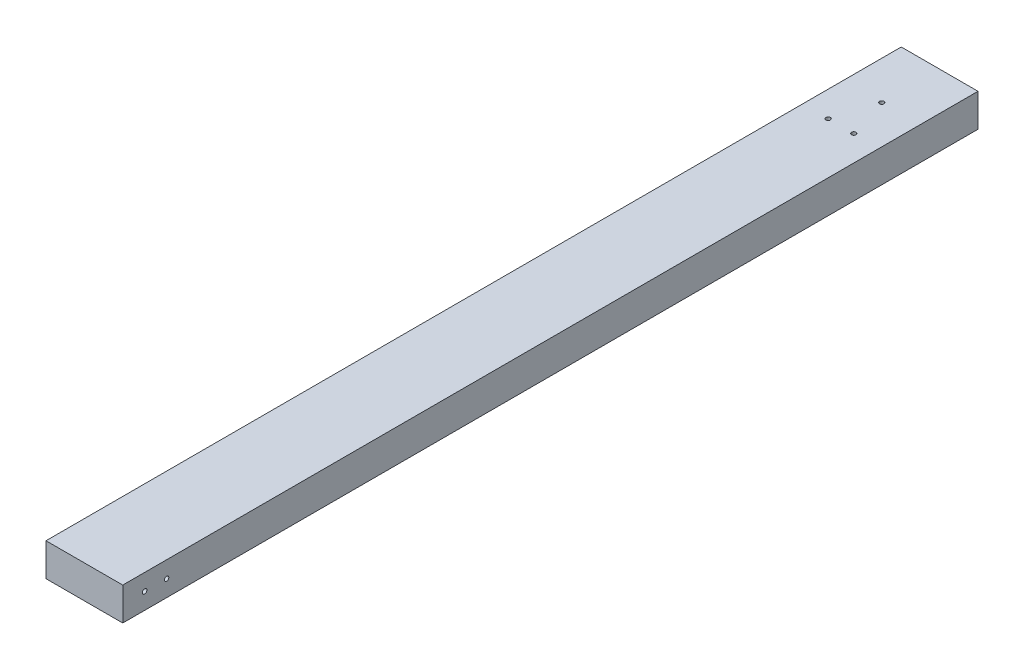
ISO-10303-21;
HEADER;
FILE_DESCRIPTION(('STEP AP214'),'2;1');
FILE_NAME('part.step','',(''),(''),'','','');
FILE_SCHEMA(('AUTOMOTIVE_DESIGN { 1 0 10303 214 1 1 1 1 }'));
ENDSEC;
DATA;
#1=APPLICATION_CONTEXT('core data for automotive mechanical design processes');
#2=APPLICATION_PROTOCOL_DEFINITION('international standard','automotive_design',2000,#1);
#3=PRODUCT_CONTEXT('',#1,'mechanical');
#4=PRODUCT('Part','Part','',(#3));
#5=PRODUCT_RELATED_PRODUCT_CATEGORY('part','',(#4));
#6=PRODUCT_DEFINITION_FORMATION('','',#4);
#7=PRODUCT_DEFINITION_CONTEXT('part definition',#1,'design');
#8=PRODUCT_DEFINITION('design','',#6,#7);
#9=PRODUCT_DEFINITION_SHAPE('','',#8);
#10=(LENGTH_UNIT() NAMED_UNIT(*) SI_UNIT(.MILLI.,.METRE.));
#11=(NAMED_UNIT(*) PLANE_ANGLE_UNIT() SI_UNIT($,.RADIAN.));
#12=(NAMED_UNIT(*) SI_UNIT($,.STERADIAN.) SOLID_ANGLE_UNIT());
#13=UNCERTAINTY_MEASURE_WITH_UNIT(LENGTH_MEASURE(1.E-05),#10,'distance_accuracy_value','');
#14=(GEOMETRIC_REPRESENTATION_CONTEXT(3) GLOBAL_UNCERTAINTY_ASSIGNED_CONTEXT((#13)) GLOBAL_UNIT_ASSIGNED_CONTEXT((#10,
#11,#12)) REPRESENTATION_CONTEXT('',''));
#15=CARTESIAN_POINT('',(0.,0.,0.));
#16=DIRECTION('',(0.,0.,1.));
#17=DIRECTION('',(1.,0.,0.));
#18=AXIS2_PLACEMENT_3D('',#15,#16,#17);
#19=CARTESIAN_POINT('',(-88.9,42.1769886363636,990.6));
#20=DIRECTION('',(1.,0.,0.));
#21=DIRECTION('',(0.,0.,-1.));
#22=AXIS2_PLACEMENT_3D('',#19,#20,#21);
#23=PLANE('',#22);
#24=CARTESIAN_POINT('',(-88.9,23.1269886363636,939.8));
#25=DIRECTION('',(-1.,0.,0.));
#26=DIRECTION('',(0.,0.,1.));
#27=AXIS2_PLACEMENT_3D('',#24,#25,#26);
#28=CIRCLE('',#27,2.57968750000001);
#29=CARTESIAN_POINT('',(-88.9,23.1269886363636,942.3796875));
#30=VERTEX_POINT('',#29);
#31=EDGE_CURVE('E137',#30,#30,#28,.T.);
#32=ORIENTED_EDGE('',*,*,#31,.F.);
#33=EDGE_LOOP('',(#32));
#34=FACE_BOUND('',#33,.T.);
#35=CARTESIAN_POINT('',(-88.9,23.1269886363636,965.2));
#36=DIRECTION('',(-1.,0.,0.));
#37=DIRECTION('',(0.,0.,1.));
#38=AXIS2_PLACEMENT_3D('',#35,#36,#37);
#39=CIRCLE('',#38,2.57968750000001);
#40=CARTESIAN_POINT('',(-88.9,23.1269886363636,967.7796875));
#41=VERTEX_POINT('',#40);
#42=EDGE_CURVE('E128',#41,#41,#39,.T.);
#43=ORIENTED_EDGE('',*,*,#42,.F.);
#44=EDGE_LOOP('',(#43));
#45=FACE_BOUND('',#44,.T.);
#46=DIRECTION('',(0.,-1.,0.));
#47=VECTOR('',#46,1.);
#48=CARTESIAN_POINT('',(-88.9,42.1769886363636,0.));
#49=LINE('',#48,#47);
#50=CARTESIAN_POINT('',(-88.9,42.1769886363636,0.));
#51=VERTEX_POINT('',#50);
#52=CARTESIAN_POINT('',(-88.9,4.07698863636363,0.));
#53=VERTEX_POINT('',#52);
#54=EDGE_CURVE('E107',#51,#53,#49,.T.);
#55=ORIENTED_EDGE('',*,*,#54,.T.);
#56=DIRECTION('',(0.,0.,-1.));
#57=VECTOR('',#56,1.);
#58=CARTESIAN_POINT('',(-88.9,4.07698863636363,990.6));
#59=LINE('',#58,#57);
#60=CARTESIAN_POINT('',(-88.9,4.07698863636363,990.6));
#61=VERTEX_POINT('',#60);
#62=EDGE_CURVE('E11',#61,#53,#59,.T.);
#63=ORIENTED_EDGE('',*,*,#62,.F.);
#64=DIRECTION('',(0.,-1.,0.));
#65=VECTOR('',#64,1.);
#66=CARTESIAN_POINT('',(-88.9,42.1769886363636,990.6));
#67=LINE('',#66,#65);
#68=CARTESIAN_POINT('',(-88.9,42.1769886363636,990.6));
#69=VERTEX_POINT('',#68);
#70=EDGE_CURVE('E91',#69,#61,#67,.T.);
#71=ORIENTED_EDGE('',*,*,#70,.F.);
#72=DIRECTION('',(0.,0.,-1.));
#73=VECTOR('',#72,1.);
#74=CARTESIAN_POINT('',(-88.9,42.1769886363636,990.6));
#75=LINE('',#74,#73);
#76=EDGE_CURVE('E103',#69,#51,#75,.T.);
#77=ORIENTED_EDGE('',*,*,#76,.T.);
#78=EDGE_LOOP('',(#55,#63,#71,#77));
#79=FACE_BOUND('',#78,.T.);
#80=ADVANCED_FACE('F39',(#34,#45,#79),#23,.F.);
#81=CARTESIAN_POINT('',(-88.9,4.07698863636363,990.6));
#82=DIRECTION('',(0.,1.,0.));
#83=DIRECTION('',(0.,0.,1.));
#84=AXIS2_PLACEMENT_3D('',#81,#82,#83);
#85=PLANE('',#84);
#86=CARTESIAN_POINT('',(-44.45,4.07698863636363,67.1138900366373));
#87=DIRECTION('',(0.,-1.,0.));
#88=DIRECTION('',(0.,0.,-1.));
#89=AXIS2_PLACEMENT_3D('',#86,#87,#88);
#90=CIRCLE('',#89,2.5796875);
#91=CARTESIAN_POINT('',(-44.45,4.07698863636363,64.5342025366373));
#92=VERTEX_POINT('',#91);
#93=EDGE_CURVE('E160',#92,#92,#90,.T.);
#94=ORIENTED_EDGE('',*,*,#93,.F.);
#95=EDGE_LOOP('',(#94));
#96=FACE_BOUND('',#95,.T.);
#97=CARTESIAN_POINT('',(-29.6333333333333,4.07698863636363,114.3));
#98=DIRECTION('',(0.,-1.,0.));
#99=DIRECTION('',(0.,0.,-1.));
#100=AXIS2_PLACEMENT_3D('',#97,#98,#99);
#101=CIRCLE('',#100,2.5796875);
#102=CARTESIAN_POINT('',(-29.6333333333333,4.07698863636363,111.7203125));
#103=VERTEX_POINT('',#102);
#104=EDGE_CURVE('E152',#103,#103,#101,.T.);
#105=ORIENTED_EDGE('',*,*,#104,.F.);
#106=EDGE_LOOP('',(#105));
#107=FACE_BOUND('',#106,.T.);
#108=CARTESIAN_POINT('',(-59.2666666666667,4.07698863636363,114.3));
#109=DIRECTION('',(0.,-1.,0.));
#110=DIRECTION('',(0.,0.,-1.));
#111=AXIS2_PLACEMENT_3D('',#108,#109,#110);
#112=CIRCLE('',#111,2.5796875);
#113=CARTESIAN_POINT('',(-59.2666666666667,4.07698863636363,111.7203125));
#114=VERTEX_POINT('',#113);
#115=EDGE_CURVE('E144',#114,#114,#112,.T.);
#116=ORIENTED_EDGE('',*,*,#115,.F.);
#117=EDGE_LOOP('',(#116));
#118=FACE_BOUND('',#117,.T.);
#119=DIRECTION('',(1.,0.,0.));
#120=VECTOR('',#119,1.);
#121=CARTESIAN_POINT('',(-88.9,4.07698863636363,0.));
#122=LINE('',#121,#120);
#123=CARTESIAN_POINT('',(0.,4.07698863636363,0.));
#124=VERTEX_POINT('',#123);
#125=EDGE_CURVE('E96',#53,#124,#122,.T.);
#126=ORIENTED_EDGE('',*,*,#125,.T.);
#127=DIRECTION('',(0.,0.,-1.));
#128=VECTOR('',#127,1.);
#129=CARTESIAN_POINT('',(0.,4.07698863636363,990.6));
#130=LINE('',#129,#128);
#131=CARTESIAN_POINT('',(0.,4.07698863636363,990.6));
#132=VERTEX_POINT('',#131);
#133=EDGE_CURVE('E48',#132,#124,#130,.T.);
#134=ORIENTED_EDGE('',*,*,#133,.F.);
#135=DIRECTION('',(1.,0.,0.));
#136=VECTOR('',#135,1.);
#137=CARTESIAN_POINT('',(-88.9,4.07698863636363,990.6));
#138=LINE('',#137,#136);
#139=EDGE_CURVE('E86',#61,#132,#138,.T.);
#140=ORIENTED_EDGE('',*,*,#139,.F.);
#141=ORIENTED_EDGE('',*,*,#62,.T.);
#142=EDGE_LOOP('',(#126,#134,#140,#141));
#143=FACE_BOUND('',#142,.T.);
#144=ADVANCED_FACE('F95',(#96,#107,#118,#143),#85,.F.);
#145=CARTESIAN_POINT('',(0.,42.1769886363636,990.6));
#146=DIRECTION('',(-1.,0.,0.));
#147=DIRECTION('',(0.,0.,1.));
#148=AXIS2_PLACEMENT_3D('',#145,#146,#147);
#149=PLANE('',#148);
#150=CARTESIAN_POINT('',(0.,23.1269886363636,939.8));
#151=DIRECTION('',(-1.,0.,0.));
#152=DIRECTION('',(0.,0.,1.));
#153=AXIS2_PLACEMENT_3D('',#150,#151,#152);
#154=CIRCLE('',#153,2.57968750000001);
#155=CARTESIAN_POINT('',(0.,23.1269886363636,942.3796875));
#156=VERTEX_POINT('',#155);
#157=EDGE_CURVE('E111',#156,#156,#154,.T.);
#158=ORIENTED_EDGE('',*,*,#157,.T.);
#159=EDGE_LOOP('',(#158));
#160=FACE_BOUND('',#159,.T.);
#161=CARTESIAN_POINT('',(0.,23.1269886363636,965.2));
#162=DIRECTION('',(-1.,0.,0.));
#163=DIRECTION('',(0.,0.,1.));
#164=AXIS2_PLACEMENT_3D('',#161,#162,#163);
#165=CIRCLE('',#164,2.57968750000001);
#166=CARTESIAN_POINT('',(0.,23.1269886363636,967.7796875));
#167=VERTEX_POINT('',#166);
#168=EDGE_CURVE('E132',#167,#167,#165,.T.);
#169=ORIENTED_EDGE('',*,*,#168,.T.);
#170=EDGE_LOOP('',(#169));
#171=FACE_BOUND('',#170,.T.);
#172=DIRECTION('',(0.,1.,0.));
#173=VECTOR('',#172,1.);
#174=CARTESIAN_POINT('',(0.,42.1769886363636,0.));
#175=LINE('',#174,#173);
#176=CARTESIAN_POINT('',(0.,42.1769886363636,0.));
#177=VERTEX_POINT('',#176);
#178=EDGE_CURVE('E73',#124,#177,#175,.T.);
#179=ORIENTED_EDGE('',*,*,#178,.T.);
#180=DIRECTION('',(0.,0.,-1.));
#181=VECTOR('',#180,1.);
#182=CARTESIAN_POINT('',(0.,42.1769886363636,990.6));
#183=LINE('',#182,#181);
#184=CARTESIAN_POINT('',(0.,42.1769886363636,990.6));
#185=VERTEX_POINT('',#184);
#186=EDGE_CURVE('E98',#185,#177,#183,.T.);
#187=ORIENTED_EDGE('',*,*,#186,.F.);
#188=DIRECTION('',(0.,1.,0.));
#189=VECTOR('',#188,1.);
#190=CARTESIAN_POINT('',(0.,42.1769886363636,990.6));
#191=LINE('',#190,#189);
#192=EDGE_CURVE('E89',#132,#185,#191,.T.);
#193=ORIENTED_EDGE('',*,*,#192,.F.);
#194=ORIENTED_EDGE('',*,*,#133,.T.);
#195=EDGE_LOOP('',(#179,#187,#193,#194));
#196=FACE_BOUND('',#195,.T.);
#197=ADVANCED_FACE('F99',(#160,#171,#196),#149,.F.);
#198=CARTESIAN_POINT('',(-88.9,42.1769886363636,990.6));
#199=DIRECTION('',(0.,-1.,0.));
#200=DIRECTION('',(0.,0.,-1.));
#201=AXIS2_PLACEMENT_3D('',#198,#199,#200);
#202=PLANE('',#201);
#203=CARTESIAN_POINT('',(-44.45,42.1769886363636,67.1138900366373));
#204=DIRECTION('',(0.,-1.,0.));
#205=DIRECTION('',(0.,0.,-1.));
#206=AXIS2_PLACEMENT_3D('',#203,#204,#205);
#207=CIRCLE('',#206,2.5796875);
#208=CARTESIAN_POINT('',(-44.45,42.1769886363636,64.5342025366373));
#209=VERTEX_POINT('',#208);
#210=EDGE_CURVE('E133',#209,#209,#207,.T.);
#211=ORIENTED_EDGE('',*,*,#210,.T.);
#212=EDGE_LOOP('',(#211));
#213=FACE_BOUND('',#212,.T.);
#214=CARTESIAN_POINT('',(-29.6333333333333,42.1769886363636,114.3));
#215=DIRECTION('',(0.,-1.,0.));
#216=DIRECTION('',(0.,0.,-1.));
#217=AXIS2_PLACEMENT_3D('',#214,#215,#216);
#218=CIRCLE('',#217,2.5796875);
#219=CARTESIAN_POINT('',(-29.6333333333333,42.1769886363636,111.7203125));
#220=VERTEX_POINT('',#219);
#221=EDGE_CURVE('E156',#220,#220,#218,.T.);
#222=ORIENTED_EDGE('',*,*,#221,.T.);
#223=EDGE_LOOP('',(#222));
#224=FACE_BOUND('',#223,.T.);
#225=CARTESIAN_POINT('',(-59.2666666666667,42.1769886363636,114.3));
#226=DIRECTION('',(0.,-1.,0.));
#227=DIRECTION('',(0.,0.,-1.));
#228=AXIS2_PLACEMENT_3D('',#225,#226,#227);
#229=CIRCLE('',#228,2.5796875);
#230=CARTESIAN_POINT('',(-59.2666666666667,42.1769886363636,111.7203125));
#231=VERTEX_POINT('',#230);
#232=EDGE_CURVE('E148',#231,#231,#229,.T.);
#233=ORIENTED_EDGE('',*,*,#232,.T.);
#234=EDGE_LOOP('',(#233));
#235=FACE_BOUND('',#234,.T.);
#236=DIRECTION('',(-1.,0.,0.));
#237=VECTOR('',#236,1.);
#238=CARTESIAN_POINT('',(-88.9,42.1769886363636,0.));
#239=LINE('',#238,#237);
#240=EDGE_CURVE('E79',#177,#51,#239,.T.);
#241=ORIENTED_EDGE('',*,*,#240,.T.);
#242=ORIENTED_EDGE('',*,*,#76,.F.);
#243=DIRECTION('',(-1.,0.,0.));
#244=VECTOR('',#243,1.);
#245=CARTESIAN_POINT('',(-88.9,42.1769886363636,990.6));
#246=LINE('',#245,#244);
#247=EDGE_CURVE('E56',#185,#69,#246,.T.);
#248=ORIENTED_EDGE('',*,*,#247,.F.);
#249=ORIENTED_EDGE('',*,*,#186,.T.);
#250=EDGE_LOOP('',(#241,#242,#248,#249));
#251=FACE_BOUND('',#250,.T.);
#252=ADVANCED_FACE('F121',(#213,#224,#235,#251),#202,.F.);
#253=CARTESIAN_POINT('',(0.,0.,990.6));
#254=DIRECTION('',(0.,0.,1.));
#255=DIRECTION('',(1.,0.,0.));
#256=AXIS2_PLACEMENT_3D('',#253,#254,#255);
#257=PLANE('',#256);
#258=ORIENTED_EDGE('',*,*,#70,.T.);
#259=ORIENTED_EDGE('',*,*,#139,.T.);
#260=ORIENTED_EDGE('',*,*,#192,.T.);
#261=ORIENTED_EDGE('',*,*,#247,.T.);
#262=EDGE_LOOP('',(#258,#259,#260,#261));
#263=FACE_BOUND('',#262,.T.);
#264=ADVANCED_FACE('F87',(#263),#257,.T.);
#265=CARTESIAN_POINT('',(0.,0.,0.));
#266=DIRECTION('',(0.,0.,1.));
#267=DIRECTION('',(1.,0.,0.));
#268=AXIS2_PLACEMENT_3D('',#265,#266,#267);
#269=PLANE('',#268);
#270=ORIENTED_EDGE('',*,*,#54,.F.);
#271=ORIENTED_EDGE('',*,*,#240,.F.);
#272=ORIENTED_EDGE('',*,*,#178,.F.);
#273=ORIENTED_EDGE('',*,*,#125,.F.);
#274=EDGE_LOOP('',(#270,#271,#272,#273));
#275=FACE_BOUND('',#274,.T.);
#276=ADVANCED_FACE('F124',(#275),#269,.F.);
#277=CARTESIAN_POINT('',(0.,23.1269886363636,965.2));
#278=DIRECTION('',(-1.,0.,0.));
#279=DIRECTION('',(0.,0.,1.));
#280=AXIS2_PLACEMENT_3D('',#277,#278,#279);
#281=CYLINDRICAL_SURFACE('',#280,2.57968750000001);
#282=ORIENTED_EDGE('',*,*,#168,.F.);
#283=EDGE_LOOP('',(#282));
#284=FACE_BOUND('',#283,.T.);
#285=ORIENTED_EDGE('',*,*,#42,.T.);
#286=EDGE_LOOP('',(#285));
#287=FACE_BOUND('',#286,.T.);
#288=ADVANCED_FACE('F194',(#284,#287),#281,.F.);
#289=CARTESIAN_POINT('',(0.,23.1269886363636,939.8));
#290=DIRECTION('',(-1.,0.,0.));
#291=DIRECTION('',(0.,0.,1.));
#292=AXIS2_PLACEMENT_3D('',#289,#290,#291);
#293=CYLINDRICAL_SURFACE('',#292,2.57968750000001);
#294=ORIENTED_EDGE('',*,*,#157,.F.);
#295=EDGE_LOOP('',(#294));
#296=FACE_BOUND('',#295,.T.);
#297=ORIENTED_EDGE('',*,*,#31,.T.);
#298=EDGE_LOOP('',(#297));
#299=FACE_BOUND('',#298,.T.);
#300=ADVANCED_FACE('F185',(#296,#299),#293,.F.);
#301=CARTESIAN_POINT('',(-59.2666666666667,42.1769886363636,114.3));
#302=DIRECTION('',(0.,-1.,0.));
#303=DIRECTION('',(0.,0.,-1.));
#304=AXIS2_PLACEMENT_3D('',#301,#302,#303);
#305=CYLINDRICAL_SURFACE('',#304,2.5796875);
#306=ORIENTED_EDGE('',*,*,#232,.F.);
#307=EDGE_LOOP('',(#306));
#308=FACE_BOUND('',#307,.T.);
#309=ORIENTED_EDGE('',*,*,#115,.T.);
#310=EDGE_LOOP('',(#309));
#311=FACE_BOUND('',#310,.T.);
#312=ADVANCED_FACE('F183',(#308,#311),#305,.F.);
#313=CARTESIAN_POINT('',(-29.6333333333333,42.1769886363636,114.3));
#314=DIRECTION('',(0.,-1.,0.));
#315=DIRECTION('',(0.,0.,-1.));
#316=AXIS2_PLACEMENT_3D('',#313,#314,#315);
#317=CYLINDRICAL_SURFACE('',#316,2.5796875);
#318=ORIENTED_EDGE('',*,*,#221,.F.);
#319=EDGE_LOOP('',(#318));
#320=FACE_BOUND('',#319,.T.);
#321=ORIENTED_EDGE('',*,*,#104,.T.);
#322=EDGE_LOOP('',(#321));
#323=FACE_BOUND('',#322,.T.);
#324=ADVANCED_FACE('F173',(#320,#323),#317,.F.);
#325=CARTESIAN_POINT('',(-44.45,42.1769886363636,67.1138900366373));
#326=DIRECTION('',(0.,-1.,0.));
#327=DIRECTION('',(0.,0.,-1.));
#328=AXIS2_PLACEMENT_3D('',#325,#326,#327);
#329=CYLINDRICAL_SURFACE('',#328,2.5796875);
#330=ORIENTED_EDGE('',*,*,#210,.F.);
#331=EDGE_LOOP('',(#330));
#332=FACE_BOUND('',#331,.T.);
#333=ORIENTED_EDGE('',*,*,#93,.T.);
#334=EDGE_LOOP('',(#333));
#335=FACE_BOUND('',#334,.T.);
#336=ADVANCED_FACE('F170',(#332,#335),#329,.F.);
#337=CLOSED_SHELL('',(#80,#144,#197,#252,#264,#276,#288,#300,#312,#324,#336));
#338=MANIFOLD_SOLID_BREP('B2',#337);
#339=ADVANCED_BREP_SHAPE_REPRESENTATION('',(#18,#338),#14);
#340=SHAPE_DEFINITION_REPRESENTATION(#9,#339);
ENDSEC;
END-ISO-10303-21;
